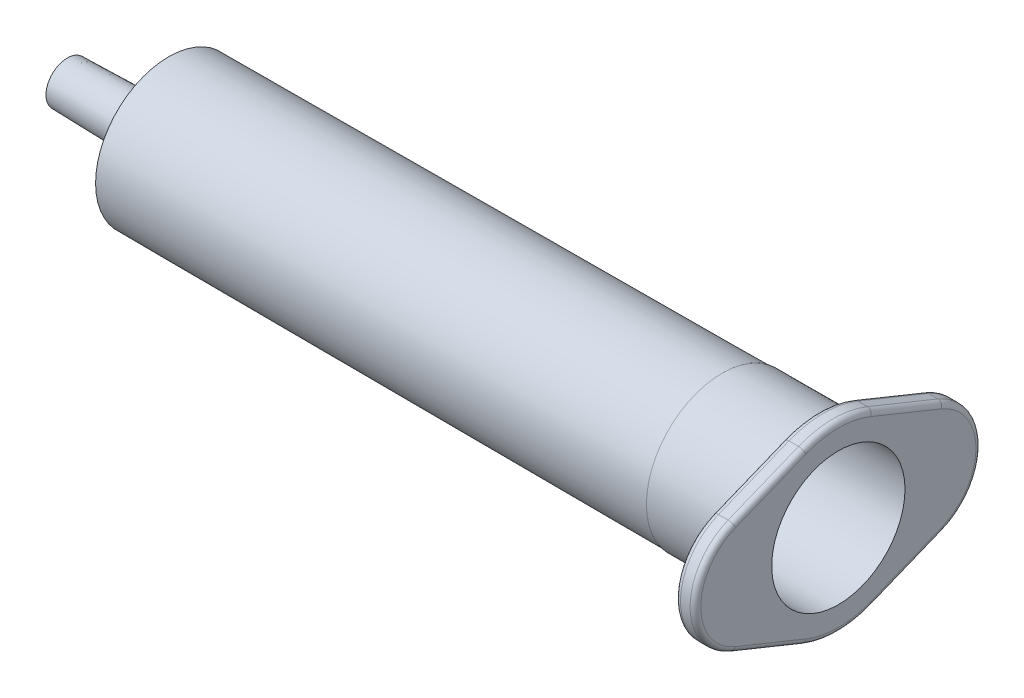
ISO-10303-21;
HEADER;
FILE_DESCRIPTION(('STEP AP214'),'2;1');
FILE_NAME('part.step','',(''),(''),'','','');
FILE_SCHEMA(('AUTOMOTIVE_DESIGN { 1 0 10303 214 1 1 1 1 }'));
ENDSEC;
DATA;
#1=APPLICATION_CONTEXT('core data for automotive mechanical design processes');
#2=APPLICATION_PROTOCOL_DEFINITION('international standard','automotive_design',2000,#1);
#3=PRODUCT_CONTEXT('',#1,'mechanical');
#4=PRODUCT('Part','Part','',(#3));
#5=PRODUCT_RELATED_PRODUCT_CATEGORY('part','',(#4));
#6=PRODUCT_DEFINITION_FORMATION('','',#4);
#7=PRODUCT_DEFINITION_CONTEXT('part definition',#1,'design');
#8=PRODUCT_DEFINITION('design','',#6,#7);
#9=PRODUCT_DEFINITION_SHAPE('','',#8);
#10=(LENGTH_UNIT() NAMED_UNIT(*) SI_UNIT(.MILLI.,.METRE.));
#11=(NAMED_UNIT(*) PLANE_ANGLE_UNIT() SI_UNIT($,.RADIAN.));
#12=(NAMED_UNIT(*) SI_UNIT($,.STERADIAN.) SOLID_ANGLE_UNIT());
#13=UNCERTAINTY_MEASURE_WITH_UNIT(LENGTH_MEASURE(1.E-05),#10,'distance_accuracy_value','');
#14=(GEOMETRIC_REPRESENTATION_CONTEXT(3) GLOBAL_UNCERTAINTY_ASSIGNED_CONTEXT((#13)) GLOBAL_UNIT_ASSIGNED_CONTEXT((#10,
#11,#12)) REPRESENTATION_CONTEXT('',''));
#15=CARTESIAN_POINT('',(0.,0.,0.));
#16=DIRECTION('',(0.,0.,1.));
#17=DIRECTION('',(1.,0.,0.));
#18=AXIS2_PLACEMENT_3D('',#15,#16,#17);
#19=CARTESIAN_POINT('',(70.4000000000012,3.20640346994704E-13,7.68880885382002));
#20=DIRECTION('',(1.,0.,0.));
#21=DIRECTION('',(0.,0.,-1.));
#22=AXIS2_PLACEMENT_3D('',#19,#20,#21);
#23=CYLINDRICAL_SURFACE('',#22,5.71119114618049);
#24=DIRECTION('',(1.,0.,0.));
#25=VECTOR('',#24,1.);
#26=CARTESIAN_POINT('',(70.4000000000012,5.29275978166862,9.83459500387454));
#27=LINE('',#26,#25);
#28=CARTESIAN_POINT('',(70.9000000000012,5.29275978166862,9.83459500387454));
#29=VERTEX_POINT('',#28);
#30=CARTESIAN_POINT('',(71.7999999999985,5.29275978166862,9.83459500387454));
#31=VERTEX_POINT('',#30);
#32=EDGE_CURVE('E157',#29,#31,#27,.T.);
#33=ORIENTED_EDGE('',*,*,#32,.F.);
#34=CARTESIAN_POINT('',(70.9000000000012,3.20640346994704E-13,7.68880885382002));
#35=DIRECTION('',(1.,0.,0.));
#36=DIRECTION('',(0.,0.,-1.));
#37=AXIS2_PLACEMENT_3D('',#34,#35,#36);
#38=CIRCLE('',#37,5.71119114618049);
#39=CARTESIAN_POINT('',(70.9000000000012,-5.29275978166786,9.83459500387445));
#40=VERTEX_POINT('',#39);
#41=EDGE_CURVE('E191',#29,#40,#38,.T.);
#42=ORIENTED_EDGE('',*,*,#41,.T.);
#43=DIRECTION('',(1.,0.,0.));
#44=VECTOR('',#43,1.);
#45=CARTESIAN_POINT('',(70.4000000000012,-5.29275978166786,9.83459500387445));
#46=LINE('',#45,#44);
#47=CARTESIAN_POINT('',(71.7999999999985,-5.29275978166786,9.83459500387445));
#48=VERTEX_POINT('',#47);
#49=EDGE_CURVE('E406',#40,#48,#46,.T.);
#50=ORIENTED_EDGE('',*,*,#49,.T.);
#51=CARTESIAN_POINT('',(71.7999999999985,3.20640346994704E-13,7.68880885382002));
#52=DIRECTION('',(1.,0.,0.));
#53=DIRECTION('',(0.,0.,-1.));
#54=AXIS2_PLACEMENT_3D('',#51,#52,#53);
#55=CIRCLE('',#54,5.71119114618049);
#56=EDGE_CURVE('E195',#48,#31,#55,.F.);
#57=ORIENTED_EDGE('',*,*,#56,.T.);
#58=EDGE_LOOP('',(#33,#42,#50,#57));
#59=FACE_BOUND('',#58,.T.);
#60=ADVANCED_FACE('F33',(#59),#23,.T.);
#61=CARTESIAN_POINT('',(70.4000000000012,9.27989288825678,6.92371507349243E-13));
#62=DIRECTION('',(0.,0.926734834502589,0.375716045065232));
#63=DIRECTION('',(0.,-0.375716045065232,0.926734834502589));
#64=AXIS2_PLACEMENT_3D('',#61,#62,#63);
#65=PLANE('',#64);
#66=DIRECTION('',(1.,0.,0.));
#67=VECTOR('',#66,1.);
#68=CARTESIAN_POINT('',(70.4000000000012,7.9699195767227,3.23115798756165));
#69=LINE('',#68,#67);
#70=CARTESIAN_POINT('',(71.7999999999985,7.9699195767227,3.23115798756165));
#71=VERTEX_POINT('',#70);
#72=CARTESIAN_POINT('',(70.9000000000012,7.9699195767227,3.23115798756165));
#73=VERTEX_POINT('',#72);
#74=EDGE_CURVE('E154',#71,#73,#69,.F.);
#75=ORIENTED_EDGE('',*,*,#74,.T.);
#76=DIRECTION('',(0.,-0.375716045065232,0.926734834502589));
#77=VECTOR('',#76,1.);
#78=CARTESIAN_POINT('',(70.9000000000012,5.29275978166861,9.83459500387454));
#79=LINE('',#78,#77);
#80=EDGE_CURVE('E162',#73,#29,#79,.T.);
#81=ORIENTED_EDGE('',*,*,#80,.T.);
#82=ORIENTED_EDGE('',*,*,#32,.T.);
#83=DIRECTION('',(0.,-0.375716045065232,0.926734834502589));
#84=VECTOR('',#83,1.);
#85=CARTESIAN_POINT('',(71.7999999999985,9.27989288825678,6.92371507349243E-13));
#86=LINE('',#85,#84);
#87=EDGE_CURVE('E150',#31,#71,#86,.F.);
#88=ORIENTED_EDGE('',*,*,#87,.T.);
#89=EDGE_LOOP('',(#75,#81,#82,#88));
#90=FACE_BOUND('',#89,.T.);
#91=ADVANCED_FACE('F152',(#90),#65,.T.);
#92=CARTESIAN_POINT('',(70.4000000000012,5.29275978166847,-9.83459500387373));
#93=DIRECTION('',(0.,0.926734834502592,-0.375716045065225));
#94=DIRECTION('',(0.,0.375716045065225,0.926734834502592));
#95=AXIS2_PLACEMENT_3D('',#92,#93,#94);
#96=PLANE('',#95);
#97=DIRECTION('',(1.,0.,0.));
#98=VECTOR('',#97,1.);
#99=CARTESIAN_POINT('',(70.4000000000012,5.29275978166847,-9.83459500387373));
#100=LINE('',#99,#98);
#101=CARTESIAN_POINT('',(70.9000000000012,5.29275978166847,-9.83459500387373));
#102=VERTEX_POINT('',#101);
#103=CARTESIAN_POINT('',(71.7999999999985,5.29275978166847,-9.83459500387373));
#104=VERTEX_POINT('',#103);
#105=EDGE_CURVE('E378',#102,#104,#100,.T.);
#106=ORIENTED_EDGE('',*,*,#105,.F.);
#107=DIRECTION('',(0.,0.375716045065225,0.926734834502592));
#108=VECTOR('',#107,1.);
#109=CARTESIAN_POINT('',(70.9000000000012,7.96991957672273,-3.23115798756028));
#110=LINE('',#109,#108);
#111=CARTESIAN_POINT('',(70.9000000000012,7.96991957672273,-3.23115798756028));
#112=VERTEX_POINT('',#111);
#113=EDGE_CURVE('E204',#102,#112,#110,.T.);
#114=ORIENTED_EDGE('',*,*,#113,.T.);
#115=DIRECTION('',(1.,0.,0.));
#116=VECTOR('',#115,1.);
#117=CARTESIAN_POINT('',(70.4000000000012,7.96991957672273,-3.23115798756028));
#118=LINE('',#117,#116);
#119=CARTESIAN_POINT('',(71.7999999999985,7.96991957672273,-3.23115798756028));
#120=VERTEX_POINT('',#119);
#121=EDGE_CURVE('E174',#112,#120,#118,.T.);
#122=ORIENTED_EDGE('',*,*,#121,.T.);
#123=DIRECTION('',(0.,0.375716045065225,0.926734834502592));
#124=VECTOR('',#123,1.);
#125=CARTESIAN_POINT('',(71.7999999999985,5.29275978166847,-9.83459500387373));
#126=LINE('',#125,#124);
#127=EDGE_CURVE('E202',#120,#104,#126,.F.);
#128=ORIENTED_EDGE('',*,*,#127,.T.);
#129=EDGE_LOOP('',(#106,#114,#122,#128));
#130=FACE_BOUND('',#129,.T.);
#131=ADVANCED_FACE('F292',(#130),#96,.T.);
#132=CARTESIAN_POINT('',(70.4000000000012,1.04245200575101E-13,-7.68880885381922));
#133=DIRECTION('',(1.,0.,0.));
#134=DIRECTION('',(0.,0.,-1.));
#135=AXIS2_PLACEMENT_3D('',#132,#133,#134);
#136=CYLINDRICAL_SURFACE('',#135,5.71119114618061);
#137=DIRECTION('',(1.,0.,0.));
#138=VECTOR('',#137,1.);
#139=CARTESIAN_POINT('',(70.4000000000012,-5.29275978166824,-9.83459500387375));
#140=LINE('',#139,#138);
#141=CARTESIAN_POINT('',(70.9000000000012,-5.29275978166824,-9.83459500387375));
#142=VERTEX_POINT('',#141);
#143=CARTESIAN_POINT('',(71.7999999999985,-5.29275978166824,-9.83459500387375));
#144=VERTEX_POINT('',#143);
#145=EDGE_CURVE('E385',#142,#144,#140,.T.);
#146=ORIENTED_EDGE('',*,*,#145,.F.);
#147=CARTESIAN_POINT('',(70.9000000000012,1.04245200575101E-13,-7.68880885381922));
#148=DIRECTION('',(1.,0.,0.));
#149=DIRECTION('',(0.,0.,-1.));
#150=AXIS2_PLACEMENT_3D('',#147,#148,#149);
#151=CIRCLE('',#150,5.71119114618061);
#152=EDGE_CURVE('E213',#142,#102,#151,.T.);
#153=ORIENTED_EDGE('',*,*,#152,.T.);
#154=ORIENTED_EDGE('',*,*,#105,.T.);
#155=CARTESIAN_POINT('',(71.7999999999985,1.04245200575101E-13,-7.68880885381922));
#156=DIRECTION('',(1.,0.,0.));
#157=DIRECTION('',(0.,0.,-1.));
#158=AXIS2_PLACEMENT_3D('',#155,#156,#157);
#159=CIRCLE('',#158,5.71119114618061);
#160=EDGE_CURVE('E210',#104,#144,#159,.F.);
#161=ORIENTED_EDGE('',*,*,#160,.T.);
#162=EDGE_LOOP('',(#146,#153,#154,#161));
#163=FACE_BOUND('',#162,.T.);
#164=ADVANCED_FACE('F382',(#163),#136,.T.);
#165=CARTESIAN_POINT('',(70.4000000000012,-9.27989288825619,-1.30104260698261E-13));
#166=DIRECTION('',(0.,-0.926734834502592,-0.375716045065223));
#167=DIRECTION('',(0.,0.375716045065223,-0.926734834502593));
#168=AXIS2_PLACEMENT_3D('',#165,#166,#167);
#169=PLANE('',#168);
#170=DIRECTION('',(1.,0.,0.));
#171=VECTOR('',#170,1.);
#172=CARTESIAN_POINT('',(70.4000000000012,-7.96991957672217,-3.23115798756104));
#173=LINE('',#172,#171);
#174=CARTESIAN_POINT('',(71.7999999999985,-7.96991957672217,-3.23115798756104));
#175=VERTEX_POINT('',#174);
#176=CARTESIAN_POINT('',(70.9000000000012,-7.96991957672217,-3.23115798756104));
#177=VERTEX_POINT('',#176);
#178=EDGE_CURVE('E393',#175,#177,#173,.F.);
#179=ORIENTED_EDGE('',*,*,#178,.T.);
#180=DIRECTION('',(0.,0.375716045065223,-0.926734834502593));
#181=VECTOR('',#180,1.);
#182=CARTESIAN_POINT('',(70.9000000000012,-5.29275978166823,-9.83459500387375));
#183=LINE('',#182,#181);
#184=EDGE_CURVE('E217',#177,#142,#183,.T.);
#185=ORIENTED_EDGE('',*,*,#184,.T.);
#186=ORIENTED_EDGE('',*,*,#145,.T.);
#187=DIRECTION('',(0.,0.375716045065223,-0.926734834502593));
#188=VECTOR('',#187,1.);
#189=CARTESIAN_POINT('',(71.7999999999985,-9.27989288825619,-1.30104260698261E-13));
#190=LINE('',#189,#188);
#191=EDGE_CURVE('E215',#144,#175,#190,.F.);
#192=ORIENTED_EDGE('',*,*,#191,.T.);
#193=EDGE_LOOP('',(#179,#185,#186,#192));
#194=FACE_BOUND('',#193,.T.);
#195=ADVANCED_FACE('F392',(#194),#169,.T.);
#196=CARTESIAN_POINT('',(70.4000000000012,-5.29275978166786,9.83459500387445));
#197=DIRECTION('',(0.,-0.926734834502593,0.375716045065221));
#198=DIRECTION('',(0.,-0.375716045065221,-0.926734834502593));
#199=AXIS2_PLACEMENT_3D('',#196,#197,#198);
#200=PLANE('',#199);
#201=ORIENTED_EDGE('',*,*,#49,.F.);
#202=DIRECTION('',(0.,-0.375716045065221,-0.926734834502593));
#203=VECTOR('',#202,1.);
#204=CARTESIAN_POINT('',(70.9000000000012,-7.96991957672218,3.23115798756078));
#205=LINE('',#204,#203);
#206=CARTESIAN_POINT('',(70.9000000000012,-7.96991957672218,3.23115798756078));
#207=VERTEX_POINT('',#206);
#208=EDGE_CURVE('E200',#40,#207,#205,.T.);
#209=ORIENTED_EDGE('',*,*,#208,.T.);
#210=DIRECTION('',(1.,0.,0.));
#211=VECTOR('',#210,1.);
#212=CARTESIAN_POINT('',(70.4000000000012,-7.96991957672218,3.23115798756078));
#213=LINE('',#212,#211);
#214=CARTESIAN_POINT('',(71.7999999999985,-7.96991957672218,3.23115798756078));
#215=VERTEX_POINT('',#214);
#216=EDGE_CURVE('E399',#207,#215,#213,.T.);
#217=ORIENTED_EDGE('',*,*,#216,.T.);
#218=DIRECTION('',(0.,-0.375716045065221,-0.926734834502593));
#219=VECTOR('',#218,1.);
#220=CARTESIAN_POINT('',(71.7999999999985,-5.29275978166786,9.83459500387445));
#221=LINE('',#220,#219);
#222=EDGE_CURVE('E193',#215,#48,#221,.F.);
#223=ORIENTED_EDGE('',*,*,#222,.T.);
#224=EDGE_LOOP('',(#201,#209,#217,#223));
#225=FACE_BOUND('',#224,.T.);
#226=ADVANCED_FACE('F296',(#225),#200,.T.);
#227=CARTESIAN_POINT('',(70.4000000000012,3.20640346994704E-13,7.68880885382002));
#228=DIRECTION('',(1.,0.,0.));
#229=DIRECTION('',(0.,0.,-1.));
#230=AXIS2_PLACEMENT_3D('',#227,#228,#229);
#231=PLANE('',#230);
#232=CARTESIAN_POINT('',(70.4000000000012,3.20640346994704E-13,7.68880885382002));
#233=DIRECTION('',(1.,0.,0.));
#234=DIRECTION('',(0.,0.,-1.));
#235=AXIS2_PLACEMENT_3D('',#232,#233,#234);
#236=CIRCLE('',#235,5.21119114618049);
#237=CARTESIAN_POINT('',(70.4000000000012,-4.82939236441657,9.64673698134184));
#238=VERTEX_POINT('',#237);
#239=CARTESIAN_POINT('',(70.4000000000012,4.82939236441726,9.6467369813419));
#240=VERTEX_POINT('',#239);
#241=EDGE_CURVE('E438',#238,#240,#236,.F.);
#242=ORIENTED_EDGE('',*,*,#241,.T.);
#243=DIRECTION('',(0.,-0.375716045065232,0.926734834502589));
#244=VECTOR('',#243,1.);
#245=CARTESIAN_POINT('',(70.4000000000012,7.50655215947141,3.04329996502904));
#246=LINE('',#245,#244);
#247=CARTESIAN_POINT('',(70.4000000000012,7.50655215947141,3.04329996502904));
#248=VERTEX_POINT('',#247);
#249=EDGE_CURVE('E440',#240,#248,#246,.F.);
#250=ORIENTED_EDGE('',*,*,#249,.T.);
#251=CARTESIAN_POINT('',(70.4000000000012,4.34981911601184E-13,6.55725473919233E-13));
#252=DIRECTION('',(1.,0.,0.));
#253=DIRECTION('',(0.,0.,-1.));
#254=AXIS2_PLACEMENT_3D('',#251,#252,#253);
#255=CIRCLE('',#254,8.1);
#256=CARTESIAN_POINT('',(70.4000000000012,7.50655215947143,-3.04329996502767));
#257=VERTEX_POINT('',#256);
#258=EDGE_CURVE('E436',#248,#257,#255,.F.);
#259=ORIENTED_EDGE('',*,*,#258,.T.);
#260=DIRECTION('',(0.,0.375716045065225,0.926734834502592));
#261=VECTOR('',#260,1.);
#262=CARTESIAN_POINT('',(70.4000000000012,4.82939236441717,-9.64673698134111));
#263=LINE('',#262,#261);
#264=CARTESIAN_POINT('',(70.4000000000012,4.82939236441717,-9.64673698134111));
#265=VERTEX_POINT('',#264);
#266=EDGE_CURVE('E432',#257,#265,#263,.F.);
#267=ORIENTED_EDGE('',*,*,#266,.T.);
#268=CARTESIAN_POINT('',(70.4000000000012,1.04245200575101E-13,-7.68880885381922));
#269=DIRECTION('',(1.,0.,0.));
#270=DIRECTION('',(0.,0.,-1.));
#271=AXIS2_PLACEMENT_3D('',#268,#269,#270);
#272=CIRCLE('',#271,5.21119114618061);
#273=CARTESIAN_POINT('',(70.4000000000012,-4.82939236441694,-9.64673698134114));
#274=VERTEX_POINT('',#273);
#275=EDGE_CURVE('E428',#265,#274,#272,.F.);
#276=ORIENTED_EDGE('',*,*,#275,.T.);
#277=DIRECTION('',(0.,0.375716045065223,-0.926734834502593));
#278=VECTOR('',#277,1.);
#279=CARTESIAN_POINT('',(70.4000000000012,-7.50655215947087,-3.04329996502843));
#280=LINE('',#279,#278);
#281=CARTESIAN_POINT('',(70.4000000000012,-7.50655215947087,-3.04329996502843));
#282=VERTEX_POINT('',#281);
#283=EDGE_CURVE('E426',#274,#282,#280,.F.);
#284=ORIENTED_EDGE('',*,*,#283,.T.);
#285=CARTESIAN_POINT('',(70.4000000000012,1.27502175484295E-13,-1.24032728532342E-13));
#286=DIRECTION('',(1.,0.,0.));
#287=DIRECTION('',(0.,0.,-1.));
#288=AXIS2_PLACEMENT_3D('',#285,#286,#287);
#289=CIRCLE('',#288,8.1);
#290=CARTESIAN_POINT('',(70.4000000000012,-7.50655215947088,3.04329996502817));
#291=VERTEX_POINT('',#290);
#292=EDGE_CURVE('E430',#282,#291,#289,.F.);
#293=ORIENTED_EDGE('',*,*,#292,.T.);
#294=DIRECTION('',(0.,-0.375716045065221,-0.926734834502593));
#295=VECTOR('',#294,1.);
#296=CARTESIAN_POINT('',(70.4000000000012,-4.82939236441656,9.64673698134184));
#297=LINE('',#296,#295);
#298=EDGE_CURVE('E434',#291,#238,#297,.F.);
#299=ORIENTED_EDGE('',*,*,#298,.T.);
#300=EDGE_LOOP('',(#242,#250,#259,#267,#276,#284,#293,#299));
#301=FACE_BOUND('',#300,.T.);
#302=CARTESIAN_POINT('',(70.4000000000012,3.67754273184448E-13,0.));
#303=DIRECTION('',(1.,0.,0.));
#304=DIRECTION('',(0.,0.,-1.));
#305=AXIS2_PLACEMENT_3D('',#302,#303,#304);
#306=CIRCLE('',#305,7.62967376398338);
#307=CARTESIAN_POINT('',(70.4000000000012,3.67754273184448E-13,-7.62967376398329));
#308=VERTEX_POINT('',#307);
#309=EDGE_CURVE('E423',#308,#308,#306,.T.);
#310=ORIENTED_EDGE('',*,*,#309,.T.);
#311=EDGE_LOOP('',(#310));
#312=FACE_BOUND('',#311,.T.);
#313=ADVANCED_FACE('F444',(#301,#312),#231,.F.);
#314=CARTESIAN_POINT('',(72.2999999999985,3.20640346994704E-13,7.68880885382002));
#315=DIRECTION('',(1.,0.,0.));
#316=DIRECTION('',(0.,0.,-1.));
#317=AXIS2_PLACEMENT_3D('',#314,#315,#316);
#318=PLANE('',#317);
#319=DIRECTION('',(0.,0.375716045065223,-0.926734834502593));
#320=VECTOR('',#319,1.);
#321=CARTESIAN_POINT('',(72.2999999999985,-10.1837119545251,3.56013705128508));
#322=LINE('',#321,#320);
#323=CARTESIAN_POINT('',(72.2999999999985,-7.50655215947088,-3.04329996502843));
#324=VERTEX_POINT('',#323);
#325=CARTESIAN_POINT('',(72.2999999999985,-4.82939236441694,-9.64673698134114));
#326=VERTEX_POINT('',#325);
#327=EDGE_CURVE('E56',#324,#326,#322,.T.);
#328=ORIENTED_EDGE('',*,*,#327,.T.);
#329=CARTESIAN_POINT('',(72.2999999999985,1.04245200575101E-13,-7.68880885381922));
#330=DIRECTION('',(1.,0.,0.));
#331=DIRECTION('',(0.,0.,-1.));
#332=AXIS2_PLACEMENT_3D('',#329,#330,#331);
#333=CIRCLE('',#332,5.21119114618061);
#334=CARTESIAN_POINT('',(72.2999999999985,4.82939236441717,-9.64673698134111));
#335=VERTEX_POINT('',#334);
#336=EDGE_CURVE('E231',#326,#335,#333,.T.);
#337=ORIENTED_EDGE('',*,*,#336,.T.);
#338=DIRECTION('',(0.,0.375716045065225,0.926734834502592));
#339=VECTOR('',#338,1.);
#340=CARTESIAN_POINT('',(72.2999999999985,10.1837119545254,3.56013705128519));
#341=LINE('',#340,#339);
#342=CARTESIAN_POINT('',(72.2999999999985,7.50655215947143,-3.04329996502767));
#343=VERTEX_POINT('',#342);
#344=EDGE_CURVE('E229',#335,#343,#341,.T.);
#345=ORIENTED_EDGE('',*,*,#344,.T.);
#346=CARTESIAN_POINT('',(72.2999999999985,4.34981911601184E-13,6.55725473919233E-13));
#347=DIRECTION('',(1.,0.,0.));
#348=DIRECTION('',(0.,0.,-1.));
#349=AXIS2_PLACEMENT_3D('',#346,#347,#348);
#350=CIRCLE('',#349,8.1);
#351=CARTESIAN_POINT('',(72.2999999999985,7.50655215947141,3.04329996502904));
#352=VERTEX_POINT('',#351);
#353=EDGE_CURVE('E226',#343,#352,#350,.T.);
#354=ORIENTED_EDGE('',*,*,#353,.T.);
#355=DIRECTION('',(0.,-0.375716045065232,0.926734834502589));
#356=VECTOR('',#355,1.);
#357=CARTESIAN_POINT('',(72.2999999999985,4.82939236441732,9.64673698134193));
#358=LINE('',#357,#356);
#359=CARTESIAN_POINT('',(72.2999999999985,4.82939236441726,9.6467369813419));
#360=VERTEX_POINT('',#359);
#361=EDGE_CURVE('E180',#352,#360,#358,.T.);
#362=ORIENTED_EDGE('',*,*,#361,.T.);
#363=CARTESIAN_POINT('',(72.2999999999985,3.20640346994704E-13,7.68880885382002));
#364=DIRECTION('',(1.,0.,0.));
#365=DIRECTION('',(0.,0.,-1.));
#366=AXIS2_PLACEMENT_3D('',#363,#364,#365);
#367=CIRCLE('',#366,5.21119114618049);
#368=CARTESIAN_POINT('',(72.2999999999985,-4.82939236441663,9.64673698134187));
#369=VERTEX_POINT('',#368);
#370=EDGE_CURVE('E219',#360,#369,#367,.T.);
#371=ORIENTED_EDGE('',*,*,#370,.T.);
#372=DIRECTION('',(0.,-0.375716045065221,-0.926734834502593));
#373=VECTOR('',#372,1.);
#374=CARTESIAN_POINT('',(72.2999999999985,-4.82939236441657,9.64673698134182));
#375=LINE('',#374,#373);
#376=CARTESIAN_POINT('',(72.2999999999985,-7.50655215947088,3.04329996502817));
#377=VERTEX_POINT('',#376);
#378=EDGE_CURVE('E221',#369,#377,#375,.T.);
#379=ORIENTED_EDGE('',*,*,#378,.T.);
#380=CARTESIAN_POINT('',(72.2999999999985,1.27502175484295E-13,-1.24032728532342E-13));
#381=DIRECTION('',(1.,0.,0.));
#382=DIRECTION('',(0.,0.,-1.));
#383=AXIS2_PLACEMENT_3D('',#380,#381,#382);
#384=CIRCLE('',#383,8.1);
#385=EDGE_CURVE('E224',#377,#324,#384,.T.);
#386=ORIENTED_EDGE('',*,*,#385,.T.);
#387=EDGE_LOOP('',(#328,#337,#345,#354,#362,#371,#379,#386));
#388=FACE_BOUND('',#387,.T.);
#389=CARTESIAN_POINT('',(72.2999999999985,0.,1.25564390031332E-13));
#390=DIRECTION('',(1.,0.,0.));
#391=DIRECTION('',(0.,0.,-1.));
#392=AXIS2_PLACEMENT_3D('',#389,#390,#391);
#393=CIRCLE('',#392,6.25000000000037);
#394=CARTESIAN_POINT('',(72.2999999999985,0.,-6.25000000000024));
#395=VERTEX_POINT('',#394);
#396=EDGE_CURVE('E259',#395,#395,#393,.T.);
#397=ORIENTED_EDGE('',*,*,#396,.F.);
#398=EDGE_LOOP('',(#397));
#399=FACE_BOUND('',#398,.T.);
#400=ADVANCED_FACE('F372',(#388,#399),#318,.T.);
#401=CARTESIAN_POINT('',(61.4000000000012,3.67754273184448E-13,1.06634212281108E-13));
#402=DIRECTION('',(1.,0.,0.));
#403=DIRECTION('',(0.,0.,-1.));
#404=AXIS2_PLACEMENT_3D('',#401,#402,#403);
#405=CONICAL_SURFACE('',#404,7.10000000000007,0.00349065850399727);
#406=CARTESIAN_POINT('',(69.9017453257094,3.67754273184448E-13,1.21399308629992E-13));
#407=DIRECTION('',(-1.,0.,0.));
#408=DIRECTION('',(0.,0.,1.));
#409=AXIS2_PLACEMENT_3D('',#406,#407,#408);
#410=CIRCLE('',#409,7.12967681015448);
#411=CARTESIAN_POINT('',(69.9017453257094,3.67754273184448E-13,7.12967681015461));
#412=VERTEX_POINT('',#411);
#413=EDGE_CURVE('E233',#412,#412,#410,.T.);
#414=ORIENTED_EDGE('',*,*,#413,.T.);
#415=EDGE_LOOP('',(#414));
#416=FACE_BOUND('',#415,.T.);
#417=CARTESIAN_POINT('',(61.4000000000012,3.67754273184448E-13,1.06634212281108E-13));
#418=DIRECTION('',(-1.,0.,0.));
#419=DIRECTION('',(0.,0.,1.));
#420=AXIS2_PLACEMENT_3D('',#417,#418,#419);
#421=CIRCLE('',#420,7.10000000000007);
#422=CARTESIAN_POINT('',(61.4000000000012,3.67754273184448E-13,7.10000000000018));
#423=VERTEX_POINT('',#422);
#424=EDGE_CURVE('E409',#423,#423,#421,.T.);
#425=ORIENTED_EDGE('',*,*,#424,.F.);
#426=EDGE_LOOP('',(#425));
#427=FACE_BOUND('',#426,.T.);
#428=ADVANCED_FACE('F472',(#416,#427),#405,.T.);
#429=CARTESIAN_POINT('',(61.4000000000011,7.0311659121752,1.06634212281108E-13));
#430=DIRECTION('',(-1.,0.,0.));
#431=DIRECTION('',(0.,0.,1.));
#432=AXIS2_PLACEMENT_3D('',#429,#430,#431);
#433=PLANE('',#432);
#434=ORIENTED_EDGE('',*,*,#424,.T.);
#435=EDGE_LOOP('',(#434));
#436=FACE_BOUND('',#435,.T.);
#437=CARTESIAN_POINT('',(61.400000000001,3.67754273184448E-13,1.06634212281108E-13));
#438=DIRECTION('',(-1.,0.,0.));
#439=DIRECTION('',(0.,0.,1.));
#440=AXIS2_PLACEMENT_3D('',#437,#438,#439);
#441=CIRCLE('',#440,7.03116591217483);
#442=CARTESIAN_POINT('',(61.400000000001,3.67754273184448E-13,7.03116591217494));
#443=VERTEX_POINT('',#442);
#444=EDGE_CURVE('E413',#443,#443,#441,.T.);
#445=ORIENTED_EDGE('',*,*,#444,.F.);
#446=EDGE_LOOP('',(#445));
#447=FACE_BOUND('',#446,.T.);
#448=ADVANCED_FACE('F478',(#436,#447),#433,.T.);
#449=CARTESIAN_POINT('',(9.4999999999974,3.67754273184448E-13,0.));
#450=DIRECTION('',(1.,0.,0.));
#451=DIRECTION('',(0.,0.,-1.));
#452=AXIS2_PLACEMENT_3D('',#449,#450,#451);
#453=CONICAL_SURFACE('',#452,6.84999999999993,0.00349065850398954);
#454=ORIENTED_EDGE('',*,*,#444,.T.);
#455=EDGE_LOOP('',(#454));
#456=FACE_BOUND('',#455,.T.);
#457=CARTESIAN_POINT('',(9.4999999999974,3.67754273184448E-13,0.));
#458=DIRECTION('',(-1.,0.,0.));
#459=DIRECTION('',(0.,0.,1.));
#460=AXIS2_PLACEMENT_3D('',#457,#458,#459);
#461=CIRCLE('',#460,6.84999999999993);
#462=CARTESIAN_POINT('',(9.49999999999739,3.67754273184448E-13,6.84999999999994));
#463=VERTEX_POINT('',#462);
#464=EDGE_CURVE('E456',#463,#463,#461,.T.);
#465=ORIENTED_EDGE('',*,*,#464,.F.);
#466=EDGE_LOOP('',(#465));
#467=FACE_BOUND('',#466,.T.);
#468=ADVANCED_FACE('F634',(#456,#467),#453,.T.);
#469=CARTESIAN_POINT('',(8.50000000000181,3.67754273184448E-13,0.));
#470=DIRECTION('',(1.,0.,0.));
#471=DIRECTION('',(0.,0.,-1.));
#472=AXIS2_PLACEMENT_3D('',#469,#470,#471);
#473=CONICAL_SURFACE('',#472,2.19999999999988,1.35896877931439);
#474=CARTESIAN_POINT('',(8.66579081728504,3.67754273184448E-13,0.));
#475=DIRECTION('',(1.,0.,0.));
#476=DIRECTION('',(0.,0.,-1.));
#477=AXIS2_PLACEMENT_3D('',#474,#475,#476);
#478=CIRCLE('',#477,2.97092730037031);
#479=CARTESIAN_POINT('',(8.66579081728504,3.67754273184448E-13,-2.97092730037029));
#480=VERTEX_POINT('',#479);
#481=EDGE_CURVE('E11',#480,#480,#478,.T.);
#482=ORIENTED_EDGE('',*,*,#481,.T.);
#483=EDGE_LOOP('',(#482));
#484=FACE_BOUND('',#483,.T.);
#485=ORIENTED_EDGE('',*,*,#464,.T.);
#486=EDGE_LOOP('',(#485));
#487=FACE_BOUND('',#486,.T.);
#488=ADVANCED_FACE('F629',(#484,#487),#473,.T.);
#489=CARTESIAN_POINT('',(0.,3.67754273184448E-13,0.));
#490=DIRECTION('',(1.,0.,0.));
#491=DIRECTION('',(0.,0.,-1.));
#492=AXIS2_PLACEMENT_3D('',#489,#490,#491);
#493=CONICAL_SURFACE('',#492,1.99999999999965,0.0235250709852388);
#494=CARTESIAN_POINT('',(7.71166540712642,3.67754273184448E-13,0.));
#495=DIRECTION('',(1.,0.,0.));
#496=DIRECTION('',(0.,0.,-1.));
#497=AXIS2_PLACEMENT_3D('',#494,#495,#496);
#498=CIRCLE('',#497,2.18145095075574);
#499=CARTESIAN_POINT('',(7.71166540712642,3.67754273184448E-13,-2.18145095075572));
#500=VERTEX_POINT('',#499);
#501=EDGE_CURVE('E41',#500,#500,#498,.F.);
#502=ORIENTED_EDGE('',*,*,#501,.T.);
#503=EDGE_LOOP('',(#502));
#504=FACE_BOUND('',#503,.T.);
#505=CARTESIAN_POINT('',(0.,3.67754273184448E-13,0.));
#506=DIRECTION('',(-1.,0.,0.));
#507=DIRECTION('',(0.,0.,1.));
#508=AXIS2_PLACEMENT_3D('',#505,#506,#507);
#509=CIRCLE('',#508,1.99999999999965);
#510=CARTESIAN_POINT('',(0.,3.67754273184448E-13,1.99999999999965));
#511=VERTEX_POINT('',#510);
#512=EDGE_CURVE('E459',#511,#511,#509,.T.);
#513=ORIENTED_EDGE('',*,*,#512,.F.);
#514=EDGE_LOOP('',(#513));
#515=FACE_BOUND('',#514,.T.);
#516=ADVANCED_FACE('F274',(#504,#515),#493,.T.);
#517=CARTESIAN_POINT('',(0.,3.67754273184448E-13,0.));
#518=DIRECTION('',(-1.,0.,0.));
#519=DIRECTION('',(0.,0.,1.));
#520=AXIS2_PLACEMENT_3D('',#517,#518,#519);
#521=PLANE('',#520);
#522=CARTESIAN_POINT('',(0.,0.,1.25564390031332E-13));
#523=DIRECTION('',(1.,0.,0.));
#524=DIRECTION('',(0.,0.,-1.));
#525=AXIS2_PLACEMENT_3D('',#522,#523,#524);
#526=CIRCLE('',#525,1.00000000000001);
#527=CARTESIAN_POINT('',(0.,0.,-0.999999999999889));
#528=VERTEX_POINT('',#527);
#529=EDGE_CURVE('E462',#528,#528,#526,.T.);
#530=ORIENTED_EDGE('',*,*,#529,.T.);
#531=EDGE_LOOP('',(#530));
#532=FACE_BOUND('',#531,.T.);
#533=ORIENTED_EDGE('',*,*,#512,.T.);
#534=EDGE_LOOP('',(#533));
#535=FACE_BOUND('',#534,.T.);
#536=ADVANCED_FACE('F645',(#532,#535),#521,.T.);
#537=CARTESIAN_POINT('',(72.2999999999985,0.,1.25564390031332E-13));
#538=DIRECTION('',(1.,0.,0.));
#539=DIRECTION('',(0.,0.,-1.));
#540=AXIS2_PLACEMENT_3D('',#537,#538,#539);
#541=CYLINDRICAL_SURFACE('',#540,1.00000000000002);
#542=CARTESIAN_POINT('',(8.85827341460052,0.,1.25564390031332E-13));
#543=DIRECTION('',(-1.,0.,0.));
#544=DIRECTION('',(0.,0.,1.));
#545=AXIS2_PLACEMENT_3D('',#542,#543,#544);
#546=CIRCLE('',#545,1.00000000000002);
#547=CARTESIAN_POINT('',(8.85827341460052,0.,1.00000000000014));
#548=VERTEX_POINT('',#547);
#549=EDGE_CURVE('E173',#548,#548,#546,.F.);
#550=ORIENTED_EDGE('',*,*,#549,.T.);
#551=EDGE_LOOP('',(#550));
#552=FACE_BOUND('',#551,.T.);
#553=ORIENTED_EDGE('',*,*,#529,.F.);
#554=EDGE_LOOP('',(#553));
#555=FACE_BOUND('',#554,.T.);
#556=ADVANCED_FACE('F658',(#552,#555),#541,.F.);
#557=CARTESIAN_POINT('',(10.1892579090191,0.,1.25564390031332E-13));
#558=DIRECTION('',(1.,0.,0.));
#559=DIRECTION('',(0.,0.,-1.));
#560=AXIS2_PLACEMENT_3D('',#557,#558,#559);
#561=CONICAL_SURFACE('',#560,6.25000000000036,1.35896877931348);
#562=CARTESIAN_POINT('',(9.10268549242413,0.,1.25564390031332E-13));
#563=DIRECTION('',(-1.,0.,0.));
#564=DIRECTION('',(0.,0.,1.));
#565=AXIS2_PLACEMENT_3D('',#562,#563,#564);
#566=CIRCLE('',#565,1.19743826283365);
#567=CARTESIAN_POINT('',(9.10268549242413,0.,1.19743826283377));
#568=VERTEX_POINT('',#567);
#569=EDGE_CURVE('E163',#568,#568,#566,.T.);
#570=ORIENTED_EDGE('',*,*,#569,.T.);
#571=EDGE_LOOP('',(#570));
#572=FACE_BOUND('',#571,.T.);
#573=CARTESIAN_POINT('',(10.1892579090191,0.,1.25564390031332E-13));
#574=DIRECTION('',(1.,0.,0.));
#575=DIRECTION('',(0.,0.,-1.));
#576=AXIS2_PLACEMENT_3D('',#573,#574,#575);
#577=CIRCLE('',#576,6.25000000000036);
#578=CARTESIAN_POINT('',(10.1892579090191,0.,-6.25000000000023));
#579=VERTEX_POINT('',#578);
#580=EDGE_CURVE('E465',#579,#579,#577,.T.);
#581=ORIENTED_EDGE('',*,*,#580,.T.);
#582=EDGE_LOOP('',(#581));
#583=FACE_BOUND('',#582,.T.);
#584=ADVANCED_FACE('F667',(#572,#583),#561,.F.);
#585=CARTESIAN_POINT('',(72.2999999999985,0.,1.25564390031332E-13));
#586=DIRECTION('',(1.,0.,0.));
#587=DIRECTION('',(0.,0.,-1.));
#588=AXIS2_PLACEMENT_3D('',#585,#586,#587);
#589=CYLINDRICAL_SURFACE('',#588,6.25000000000036);
#590=ORIENTED_EDGE('',*,*,#580,.F.);
#591=EDGE_LOOP('',(#590));
#592=FACE_BOUND('',#591,.T.);
#593=ORIENTED_EDGE('',*,*,#396,.T.);
#594=EDGE_LOOP('',(#593));
#595=FACE_BOUND('',#594,.T.);
#596=ADVANCED_FACE('F301',(#592,#595),#589,.F.);
#597=CARTESIAN_POINT('',(70.4000000000012,1.27502175484295E-13,-1.24032728532342E-13));
#598=DIRECTION('',(1.,0.,0.));
#599=DIRECTION('',(0.,0.,-1.));
#600=AXIS2_PLACEMENT_3D('',#597,#598,#599);
#601=CYLINDRICAL_SURFACE('',#600,8.6);
#602=ORIENTED_EDGE('',*,*,#216,.F.);
#603=CARTESIAN_POINT('',(70.9000000000012,1.27502175484295E-13,-1.24032728532342E-13));
#604=DIRECTION('',(1.,0.,0.));
#605=DIRECTION('',(0.,0.,-1.));
#606=AXIS2_PLACEMENT_3D('',#603,#604,#605);
#607=CIRCLE('',#606,8.6);
#608=EDGE_CURVE('E208',#207,#177,#607,.T.);
#609=ORIENTED_EDGE('',*,*,#608,.T.);
#610=ORIENTED_EDGE('',*,*,#178,.F.);
#611=CARTESIAN_POINT('',(71.7999999999985,1.27502175484295E-13,-1.24032728532342E-13));
#612=DIRECTION('',(1.,0.,0.));
#613=DIRECTION('',(0.,0.,-1.));
#614=AXIS2_PLACEMENT_3D('',#611,#612,#613);
#615=CIRCLE('',#614,8.6);
#616=EDGE_CURVE('E206',#175,#215,#615,.F.);
#617=ORIENTED_EDGE('',*,*,#616,.T.);
#618=EDGE_LOOP('',(#602,#609,#610,#617));
#619=FACE_BOUND('',#618,.T.);
#620=ADVANCED_FACE('F298',(#619),#601,.T.);
#621=CARTESIAN_POINT('',(70.4000000000012,4.34981911601184E-13,6.55725473919233E-13));
#622=DIRECTION('',(1.,0.,0.));
#623=DIRECTION('',(0.,0.,-1.));
#624=AXIS2_PLACEMENT_3D('',#621,#622,#623);
#625=CYLINDRICAL_SURFACE('',#624,8.6);
#626=ORIENTED_EDGE('',*,*,#121,.F.);
#627=CARTESIAN_POINT('',(70.9000000000012,4.34981911601184E-13,6.55725473919233E-13));
#628=DIRECTION('',(1.,0.,0.));
#629=DIRECTION('',(0.,0.,-1.));
#630=AXIS2_PLACEMENT_3D('',#627,#628,#629);
#631=CIRCLE('',#630,8.6);
#632=EDGE_CURVE('E172',#112,#73,#631,.T.);
#633=ORIENTED_EDGE('',*,*,#632,.T.);
#634=ORIENTED_EDGE('',*,*,#74,.F.);
#635=CARTESIAN_POINT('',(71.7999999999985,4.34981911601184E-13,6.55725473919233E-13));
#636=DIRECTION('',(1.,0.,0.));
#637=DIRECTION('',(0.,0.,-1.));
#638=AXIS2_PLACEMENT_3D('',#635,#636,#637);
#639=CIRCLE('',#638,8.6);
#640=EDGE_CURVE('E169',#71,#120,#639,.F.);
#641=ORIENTED_EDGE('',*,*,#640,.T.);
#642=EDGE_LOOP('',(#626,#633,#634,#641));
#643=FACE_BOUND('',#642,.T.);
#644=ADVANCED_FACE('F167',(#643),#625,.T.);
#645=CARTESIAN_POINT('',(8.85827341460052,0.,1.25564390031332E-13));
#646=DIRECTION('',(-1.,0.,0.));
#647=DIRECTION('',(0.,0.,1.));
#648=AXIS2_PLACEMENT_3D('',#645,#646,#647);
#649=TOROIDAL_SURFACE('',#648,1.25000000000002,0.25);
#650=ORIENTED_EDGE('',*,*,#569,.F.);
#651=EDGE_LOOP('',(#650));
#652=FACE_BOUND('',#651,.T.);
#653=ORIENTED_EDGE('',*,*,#549,.F.);
#654=EDGE_LOOP('',(#653));
#655=FACE_BOUND('',#654,.T.);
#656=ADVANCED_FACE('F305',(#652,#655),#649,.T.);
#657=CARTESIAN_POINT('',(70.9000000000012,-8.81652547100489,0.187858022532482));
#658=DIRECTION('',(0.,-0.375716045065223,0.926734834502593));
#659=DIRECTION('',(0.,-0.926734834502593,-0.375716045065223));
#660=AXIS2_PLACEMENT_3D('',#657,#658,#659);
#661=CYLINDRICAL_SURFACE('',#660,0.500000000000001);
#662=CARTESIAN_POINT('',(70.9000000000012,-7.50655215947087,-3.04329996502843));
#663=DIRECTION('',(0.,-0.375716045065224,0.926734834502592));
#664=DIRECTION('',(0.,-0.926734834502592,-0.375716045065224));
#665=AXIS2_PLACEMENT_3D('',#662,#663,#664);
#666=CIRCLE('',#665,0.500000000000001);
#667=EDGE_CURVE('E253',#282,#177,#666,.T.);
#668=ORIENTED_EDGE('',*,*,#667,.F.);
#669=ORIENTED_EDGE('',*,*,#283,.F.);
#670=CARTESIAN_POINT('',(70.9000000000012,-4.82939236441693,-9.64673698134114));
#671=DIRECTION('',(0.,0.375716045065223,-0.926734834502592));
#672=DIRECTION('',(0.,0.926734834502592,0.375716045065223));
#673=AXIS2_PLACEMENT_3D('',#670,#671,#672);
#674=CIRCLE('',#673,0.500000000000001);
#675=EDGE_CURVE('E256',#142,#274,#674,.T.);
#676=ORIENTED_EDGE('',*,*,#675,.F.);
#677=ORIENTED_EDGE('',*,*,#184,.F.);
#678=EDGE_LOOP('',(#668,#669,#676,#677));
#679=FACE_BOUND('',#678,.T.);
#680=ADVANCED_FACE('F308',(#679),#661,.T.);
#681=CARTESIAN_POINT('',(70.9000000000012,1.04245200575101E-13,-7.68880885381922));
#682=DIRECTION('',(1.,0.,0.));
#683=DIRECTION('',(0.,0.,-1.));
#684=AXIS2_PLACEMENT_3D('',#681,#682,#683);
#685=TOROIDAL_SURFACE('',#684,5.21119114618061,0.500000000000001);
#686=ORIENTED_EDGE('',*,*,#675,.T.);
#687=ORIENTED_EDGE('',*,*,#275,.F.);
#688=CARTESIAN_POINT('',(70.9000000000012,4.82939236441716,-9.64673698134111));
#689=DIRECTION('',(0.,0.375716045065223,0.926734834502592));
#690=DIRECTION('',(0.,-0.926734834502592,0.375716045065223));
#691=AXIS2_PLACEMENT_3D('',#688,#689,#690);
#692=CIRCLE('',#691,0.500000000000001);
#693=EDGE_CURVE('E250',#102,#265,#692,.T.);
#694=ORIENTED_EDGE('',*,*,#693,.F.);
#695=ORIENTED_EDGE('',*,*,#152,.F.);
#696=EDGE_LOOP('',(#686,#687,#694,#695));
#697=FACE_BOUND('',#696,.T.);
#698=ADVANCED_FACE('F334',(#697),#685,.T.);
#699=CARTESIAN_POINT('',(70.9000000000012,1.27502175484295E-13,-1.24032728532342E-13));
#700=DIRECTION('',(1.,0.,0.));
#701=DIRECTION('',(0.,0.,-1.));
#702=AXIS2_PLACEMENT_3D('',#699,#700,#701);
#703=TOROIDAL_SURFACE('',#702,8.1,0.500000000000001);
#704=ORIENTED_EDGE('',*,*,#667,.T.);
#705=ORIENTED_EDGE('',*,*,#608,.F.);
#706=CARTESIAN_POINT('',(70.9000000000012,-7.50655215947088,3.04329996502817));
#707=DIRECTION('',(0.,0.375716045065221,0.926734834502593));
#708=DIRECTION('',(0.,-0.926734834502593,0.375716045065221));
#709=AXIS2_PLACEMENT_3D('',#706,#707,#708);
#710=CIRCLE('',#709,0.500000000000001);
#711=EDGE_CURVE('E247',#291,#207,#710,.T.);
#712=ORIENTED_EDGE('',*,*,#711,.F.);
#713=ORIENTED_EDGE('',*,*,#292,.F.);
#714=EDGE_LOOP('',(#704,#705,#712,#713));
#715=FACE_BOUND('',#714,.T.);
#716=ADVANCED_FACE('F330',(#715),#703,.T.);
#717=CARTESIAN_POINT('',(70.9000000000012,4.82939236441717,-9.64673698134111));
#718=DIRECTION('',(0.,-0.375716045065225,-0.926734834502592));
#719=DIRECTION('',(0.,0.926734834502592,-0.375716045065225));
#720=AXIS2_PLACEMENT_3D('',#717,#718,#719);
#721=CYLINDRICAL_SURFACE('',#720,0.500000000000001);
#722=ORIENTED_EDGE('',*,*,#693,.T.);
#723=ORIENTED_EDGE('',*,*,#266,.F.);
#724=CARTESIAN_POINT('',(70.9000000000012,7.50655215947143,-3.04329996502767));
#725=DIRECTION('',(0.,0.375716045065225,0.926734834502591));
#726=DIRECTION('',(0.,-0.926734834502591,0.375716045065225));
#727=AXIS2_PLACEMENT_3D('',#724,#725,#726);
#728=CIRCLE('',#727,0.500000000000001);
#729=EDGE_CURVE('E244',#112,#257,#728,.T.);
#730=ORIENTED_EDGE('',*,*,#729,.F.);
#731=ORIENTED_EDGE('',*,*,#113,.F.);
#732=EDGE_LOOP('',(#722,#723,#730,#731));
#733=FACE_BOUND('',#732,.T.);
#734=ADVANCED_FACE('F326',(#733),#721,.T.);
#735=CARTESIAN_POINT('',(70.9000000000012,-4.82939236441656,9.64673698134184));
#736=DIRECTION('',(0.,0.375716045065221,0.926734834502593));
#737=DIRECTION('',(0.,-0.926734834502593,0.375716045065221));
#738=AXIS2_PLACEMENT_3D('',#735,#736,#737);
#739=CYLINDRICAL_SURFACE('',#738,0.500000000000001);
#740=ORIENTED_EDGE('',*,*,#711,.T.);
#741=ORIENTED_EDGE('',*,*,#208,.F.);
#742=CARTESIAN_POINT('',(70.9000000000012,-4.82939236441657,9.64673698134184));
#743=DIRECTION('',(0.,0.375716045065224,0.926734834502592));
#744=DIRECTION('',(0.,-0.926734834502592,0.375716045065224));
#745=AXIS2_PLACEMENT_3D('',#742,#743,#744);
#746=CIRCLE('',#745,0.500000000000001);
#747=EDGE_CURVE('E241',#238,#40,#746,.T.);
#748=ORIENTED_EDGE('',*,*,#747,.F.);
#749=ORIENTED_EDGE('',*,*,#298,.F.);
#750=EDGE_LOOP('',(#740,#741,#748,#749));
#751=FACE_BOUND('',#750,.T.);
#752=ADVANCED_FACE('F322',(#751),#739,.T.);
#753=CARTESIAN_POINT('',(70.9000000000012,4.34981911601184E-13,6.55725473919233E-13));
#754=DIRECTION('',(1.,0.,0.));
#755=DIRECTION('',(0.,0.,-1.));
#756=AXIS2_PLACEMENT_3D('',#753,#754,#755);
#757=TOROIDAL_SURFACE('',#756,8.1,0.500000000000001);
#758=ORIENTED_EDGE('',*,*,#729,.T.);
#759=ORIENTED_EDGE('',*,*,#258,.F.);
#760=CARTESIAN_POINT('',(70.9000000000012,7.50655215947141,3.04329996502904));
#761=DIRECTION('',(0.,-0.375716045065232,0.926734834502589));
#762=DIRECTION('',(0.,-0.926734834502589,-0.375716045065232));
#763=AXIS2_PLACEMENT_3D('',#760,#761,#762);
#764=CIRCLE('',#763,0.500000000000001);
#765=EDGE_CURVE('E238',#73,#248,#764,.T.);
#766=ORIENTED_EDGE('',*,*,#765,.F.);
#767=ORIENTED_EDGE('',*,*,#632,.F.);
#768=EDGE_LOOP('',(#758,#759,#766,#767));
#769=FACE_BOUND('',#768,.T.);
#770=ADVANCED_FACE('F318',(#769),#757,.T.);
#771=CARTESIAN_POINT('',(70.9000000000012,3.20640346994704E-13,7.68880885382002));
#772=DIRECTION('',(1.,0.,0.));
#773=DIRECTION('',(0.,0.,-1.));
#774=AXIS2_PLACEMENT_3D('',#771,#772,#773);
#775=TOROIDAL_SURFACE('',#774,5.21119114618049,0.500000000000001);
#776=ORIENTED_EDGE('',*,*,#747,.T.);
#777=ORIENTED_EDGE('',*,*,#41,.F.);
#778=CARTESIAN_POINT('',(70.9000000000012,4.82939236441726,9.6467369813419));
#779=DIRECTION('',(0.,0.375716045065228,-0.92673483450259));
#780=DIRECTION('',(0.,0.926734834502591,0.375716045065228));
#781=AXIS2_PLACEMENT_3D('',#778,#779,#780);
#782=CIRCLE('',#781,0.500000000000001);
#783=EDGE_CURVE('E236',#240,#29,#782,.T.);
#784=ORIENTED_EDGE('',*,*,#783,.F.);
#785=ORIENTED_EDGE('',*,*,#241,.F.);
#786=EDGE_LOOP('',(#776,#777,#784,#785));
#787=FACE_BOUND('',#786,.T.);
#788=ADVANCED_FACE('F314',(#787),#775,.T.);
#789=CARTESIAN_POINT('',(70.9000000000012,8.81652547100548,-0.187858022531924));
#790=DIRECTION('',(0.,0.375716045065232,-0.926734834502589));
#791=DIRECTION('',(0.,0.926734834502589,0.375716045065232));
#792=AXIS2_PLACEMENT_3D('',#789,#790,#791);
#793=CYLINDRICAL_SURFACE('',#792,0.500000000000001);
#794=ORIENTED_EDGE('',*,*,#765,.T.);
#795=ORIENTED_EDGE('',*,*,#249,.F.);
#796=ORIENTED_EDGE('',*,*,#783,.T.);
#797=ORIENTED_EDGE('',*,*,#80,.F.);
#798=EDGE_LOOP('',(#794,#795,#796,#797));
#799=FACE_BOUND('',#798,.T.);
#800=ADVANCED_FACE('F310',(#799),#793,.T.);
#801=CARTESIAN_POINT('',(71.7999999999985,3.20640346994704E-13,7.68880885382002));
#802=DIRECTION('',(1.,0.,0.));
#803=DIRECTION('',(0.,0.,-1.));
#804=AXIS2_PLACEMENT_3D('',#801,#802,#803);
#805=TOROIDAL_SURFACE('',#804,5.21119114618049,0.500000000000001);
#806=CARTESIAN_POINT('',(71.7999999999985,4.82939236441726,9.6467369813419));
#807=DIRECTION('',(0.,0.375716045065231,-0.926734834502589));
#808=DIRECTION('',(0.,0.926734834502589,0.375716045065231));
#809=AXIS2_PLACEMENT_3D('',#806,#807,#808);
#810=CIRCLE('',#809,0.500000000000001);
#811=EDGE_CURVE('E268',#31,#360,#810,.T.);
#812=ORIENTED_EDGE('',*,*,#811,.F.);
#813=ORIENTED_EDGE('',*,*,#56,.F.);
#814=CARTESIAN_POINT('',(71.7999999999985,-4.82939236441663,9.64673698134187));
#815=DIRECTION('',(0.,-0.37571604506522,-0.926734834502594));
#816=DIRECTION('',(0.,0.926734834502594,-0.37571604506522));
#817=AXIS2_PLACEMENT_3D('',#814,#815,#816);
#818=CIRCLE('',#817,0.500000000000001);
#819=EDGE_CURVE('E239',#369,#48,#818,.T.);
#820=ORIENTED_EDGE('',*,*,#819,.F.);
#821=ORIENTED_EDGE('',*,*,#370,.F.);
#822=EDGE_LOOP('',(#812,#813,#820,#821));
#823=FACE_BOUND('',#822,.T.);
#824=ADVANCED_FACE('F313',(#823),#805,.T.);
#825=CARTESIAN_POINT('',(71.7999999999985,-4.82939236441657,9.64673698134182));
#826=DIRECTION('',(0.,-0.375716045065221,-0.926734834502593));
#827=DIRECTION('',(0.,0.926734834502593,-0.375716045065221));
#828=AXIS2_PLACEMENT_3D('',#825,#826,#827);
#829=CYLINDRICAL_SURFACE('',#828,0.500000000000001);
#830=ORIENTED_EDGE('',*,*,#819,.T.);
#831=ORIENTED_EDGE('',*,*,#222,.F.);
#832=CARTESIAN_POINT('',(71.7999999999985,-7.50655215947088,3.04329996502817));
#833=DIRECTION('',(0.,-0.375716045065222,-0.926734834502593));
#834=DIRECTION('',(0.,0.926734834502593,-0.375716045065222));
#835=AXIS2_PLACEMENT_3D('',#832,#833,#834);
#836=CIRCLE('',#835,0.500000000000001);
#837=EDGE_CURVE('E183',#377,#215,#836,.T.);
#838=ORIENTED_EDGE('',*,*,#837,.F.);
#839=ORIENTED_EDGE('',*,*,#378,.F.);
#840=EDGE_LOOP('',(#830,#831,#838,#839));
#841=FACE_BOUND('',#840,.T.);
#842=ADVANCED_FACE('F360',(#841),#829,.T.);
#843=CARTESIAN_POINT('',(71.7999999999985,4.82939236441732,9.64673698134193));
#844=DIRECTION('',(0.,-0.375716045065232,0.926734834502589));
#845=DIRECTION('',(0.,-0.926734834502589,-0.375716045065232));
#846=AXIS2_PLACEMENT_3D('',#843,#844,#845);
#847=CYLINDRICAL_SURFACE('',#846,0.500000000000001);
#848=ORIENTED_EDGE('',*,*,#811,.T.);
#849=ORIENTED_EDGE('',*,*,#361,.F.);
#850=CARTESIAN_POINT('',(71.7999999999985,7.50655215947141,3.04329996502904));
#851=DIRECTION('',(0.,0.375716045065232,-0.926734834502589));
#852=DIRECTION('',(0.,0.926734834502589,0.375716045065232));
#853=AXIS2_PLACEMENT_3D('',#850,#851,#852);
#854=CIRCLE('',#853,0.500000000000001);
#855=EDGE_CURVE('E178',#71,#352,#854,.T.);
#856=ORIENTED_EDGE('',*,*,#855,.F.);
#857=ORIENTED_EDGE('',*,*,#87,.F.);
#858=EDGE_LOOP('',(#848,#849,#856,#857));
#859=FACE_BOUND('',#858,.T.);
#860=ADVANCED_FACE('F179',(#859),#847,.T.);
#861=CARTESIAN_POINT('',(71.7999999999985,1.27502175484295E-13,-1.24032728532342E-13));
#862=DIRECTION('',(1.,0.,0.));
#863=DIRECTION('',(0.,0.,-1.));
#864=AXIS2_PLACEMENT_3D('',#861,#862,#863);
#865=TOROIDAL_SURFACE('',#864,8.1,0.500000000000001);
#866=ORIENTED_EDGE('',*,*,#837,.T.);
#867=ORIENTED_EDGE('',*,*,#616,.F.);
#868=CARTESIAN_POINT('',(71.7999999999985,-7.50655215947088,-3.04329996502843));
#869=DIRECTION('',(0.,0.375716045065223,-0.926734834502592));
#870=DIRECTION('',(0.,0.926734834502592,0.375716045065223));
#871=AXIS2_PLACEMENT_3D('',#868,#869,#870);
#872=CIRCLE('',#871,0.500000000000001);
#873=EDGE_CURVE('E184',#324,#175,#872,.T.);
#874=ORIENTED_EDGE('',*,*,#873,.F.);
#875=ORIENTED_EDGE('',*,*,#385,.F.);
#876=EDGE_LOOP('',(#866,#867,#874,#875));
#877=FACE_BOUND('',#876,.T.);
#878=ADVANCED_FACE('F354',(#877),#865,.T.);
#879=CARTESIAN_POINT('',(71.7999999999985,4.34981911601184E-13,6.55725473919233E-13));
#880=DIRECTION('',(1.,0.,0.));
#881=DIRECTION('',(0.,0.,-1.));
#882=AXIS2_PLACEMENT_3D('',#879,#880,#881);
#883=TOROIDAL_SURFACE('',#882,8.1,0.500000000000001);
#884=ORIENTED_EDGE('',*,*,#855,.T.);
#885=ORIENTED_EDGE('',*,*,#353,.F.);
#886=CARTESIAN_POINT('',(71.7999999999985,7.50655215947143,-3.04329996502767));
#887=DIRECTION('',(0.,-0.375716045065225,-0.926734834502591));
#888=DIRECTION('',(0.,0.926734834502591,-0.375716045065225));
#889=AXIS2_PLACEMENT_3D('',#886,#887,#888);
#890=CIRCLE('',#889,0.500000000000001);
#891=EDGE_CURVE('E189',#120,#343,#890,.T.);
#892=ORIENTED_EDGE('',*,*,#891,.F.);
#893=ORIENTED_EDGE('',*,*,#640,.F.);
#894=EDGE_LOOP('',(#884,#885,#892,#893));
#895=FACE_BOUND('',#894,.T.);
#896=ADVANCED_FACE('F187',(#895),#883,.T.);
#897=CARTESIAN_POINT('',(71.7999999999985,-10.1837119545251,3.56013705128508));
#898=DIRECTION('',(0.,0.375716045065223,-0.926734834502593));
#899=DIRECTION('',(0.,0.926734834502593,0.375716045065223));
#900=AXIS2_PLACEMENT_3D('',#897,#898,#899);
#901=CYLINDRICAL_SURFACE('',#900,0.500000000000001);
#902=ORIENTED_EDGE('',*,*,#873,.T.);
#903=ORIENTED_EDGE('',*,*,#191,.F.);
#904=CARTESIAN_POINT('',(71.7999999999985,-4.82939236441694,-9.64673698134114));
#905=DIRECTION('',(0.,0.37571604506523,-0.92673483450259));
#906=DIRECTION('',(0.,0.92673483450259,0.37571604506523));
#907=AXIS2_PLACEMENT_3D('',#904,#905,#906);
#908=CIRCLE('',#907,0.500000000000001);
#909=EDGE_CURVE('E261',#326,#144,#908,.T.);
#910=ORIENTED_EDGE('',*,*,#909,.F.);
#911=ORIENTED_EDGE('',*,*,#327,.F.);
#912=EDGE_LOOP('',(#902,#903,#910,#911));
#913=FACE_BOUND('',#912,.T.);
#914=ADVANCED_FACE('F347',(#913),#901,.T.);
#915=CARTESIAN_POINT('',(71.7999999999985,10.1837119545254,3.56013705128519));
#916=DIRECTION('',(0.,0.375716045065225,0.926734834502592));
#917=DIRECTION('',(0.,-0.926734834502592,0.375716045065225));
#918=AXIS2_PLACEMENT_3D('',#915,#916,#917);
#919=CYLINDRICAL_SURFACE('',#918,0.500000000000001);
#920=ORIENTED_EDGE('',*,*,#891,.T.);
#921=ORIENTED_EDGE('',*,*,#344,.F.);
#922=CARTESIAN_POINT('',(71.7999999999985,4.82939236441717,-9.64673698134111));
#923=DIRECTION('',(0.,-0.375716045065224,-0.926734834502592));
#924=DIRECTION('',(0.,0.926734834502592,-0.375716045065224));
#925=AXIS2_PLACEMENT_3D('',#922,#923,#924);
#926=CIRCLE('',#925,0.500000000000001);
#927=EDGE_CURVE('E48',#104,#335,#926,.T.);
#928=ORIENTED_EDGE('',*,*,#927,.F.);
#929=ORIENTED_EDGE('',*,*,#127,.F.);
#930=EDGE_LOOP('',(#920,#921,#928,#929));
#931=FACE_BOUND('',#930,.T.);
#932=ADVANCED_FACE('F344',(#931),#919,.T.);
#933=CARTESIAN_POINT('',(71.7999999999985,1.04245200575101E-13,-7.68880885381922));
#934=DIRECTION('',(1.,0.,0.));
#935=DIRECTION('',(0.,0.,-1.));
#936=AXIS2_PLACEMENT_3D('',#933,#934,#935);
#937=TOROIDAL_SURFACE('',#936,5.21119114618061,0.500000000000001);
#938=ORIENTED_EDGE('',*,*,#909,.T.);
#939=ORIENTED_EDGE('',*,*,#160,.F.);
#940=ORIENTED_EDGE('',*,*,#927,.T.);
#941=ORIENTED_EDGE('',*,*,#336,.F.);
#942=EDGE_LOOP('',(#938,#939,#940,#941));
#943=FACE_BOUND('',#942,.T.);
#944=ADVANCED_FACE('F283',(#943),#937,.T.);
#945=CARTESIAN_POINT('',(69.9000000000012,3.67754273184448E-13,0.));
#946=DIRECTION('',(1.,0.,0.));
#947=DIRECTION('',(0.,0.,-1.));
#948=AXIS2_PLACEMENT_3D('',#945,#946,#947);
#949=TOROIDAL_SURFACE('',#948,7.62967376398338,0.500000000000001);
#950=ORIENTED_EDGE('',*,*,#309,.F.);
#951=EDGE_LOOP('',(#950));
#952=FACE_BOUND('',#951,.T.);
#953=ORIENTED_EDGE('',*,*,#413,.F.);
#954=EDGE_LOOP('',(#953));
#955=FACE_BOUND('',#954,.T.);
#956=ADVANCED_FACE('F278',(#952,#955),#949,.F.);
#957=CARTESIAN_POINT('',(7.68814250599042,3.67754273184448E-13,0.));
#958=DIRECTION('',(-1.,0.,0.));
#959=DIRECTION('',(0.,0.,1.));
#960=AXIS2_PLACEMENT_3D('',#957,#958,#959);
#961=TOROIDAL_SURFACE('',#960,3.18117424903489,0.999999999999999);
#962=ORIENTED_EDGE('',*,*,#481,.F.);
#963=EDGE_LOOP('',(#962));
#964=FACE_BOUND('',#963,.T.);
#965=ORIENTED_EDGE('',*,*,#501,.F.);
#966=EDGE_LOOP('',(#965));
#967=FACE_BOUND('',#966,.T.);
#968=ADVANCED_FACE('F35',(#964,#967),#961,.F.);
#969=CLOSED_SHELL('',(#60,#91,#131,#164,#195,#226,#313,#400,#428,#448,#468,#488,#516,#536,#556,
#584,#596,#620,#644,#656,#680,#698,#716,#734,#752,#770,#788,#800,#824,#842,#860,#878,#896,#914,
#932,#944,#956,#968));
#970=MANIFOLD_SOLID_BREP('B2',#969);
#971=ADVANCED_BREP_SHAPE_REPRESENTATION('',(#18,#970),#14);
#972=SHAPE_DEFINITION_REPRESENTATION(#9,#971);
ENDSEC;
END-ISO-10303-21;
